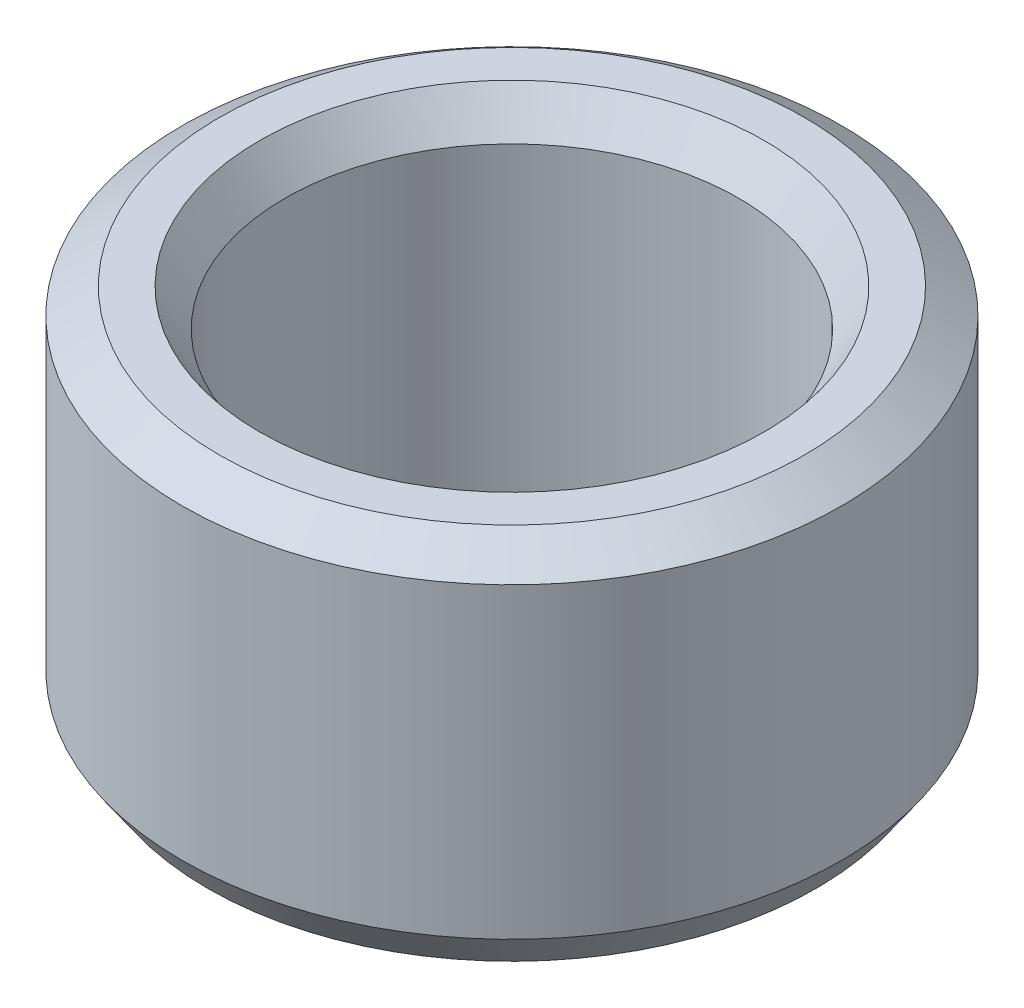
ISO-10303-21;
HEADER;
FILE_DESCRIPTION(('STEP AP214'),'2;1');
FILE_NAME('part.step','',(''),(''),'','','');
FILE_SCHEMA(('AUTOMOTIVE_DESIGN { 1 0 10303 214 1 1 1 1 }'));
ENDSEC;
DATA;
#1=APPLICATION_CONTEXT('core data for automotive mechanical design processes');
#2=APPLICATION_PROTOCOL_DEFINITION('international standard','automotive_design',2000,#1);
#3=PRODUCT_CONTEXT('',#1,'mechanical');
#4=PRODUCT('Part','Part','',(#3));
#5=PRODUCT_RELATED_PRODUCT_CATEGORY('part','',(#4));
#6=PRODUCT_DEFINITION_FORMATION('','',#4);
#7=PRODUCT_DEFINITION_CONTEXT('part definition',#1,'design');
#8=PRODUCT_DEFINITION('design','',#6,#7);
#9=PRODUCT_DEFINITION_SHAPE('','',#8);
#10=(LENGTH_UNIT() NAMED_UNIT(*) SI_UNIT(.MILLI.,.METRE.));
#11=(NAMED_UNIT(*) PLANE_ANGLE_UNIT() SI_UNIT($,.RADIAN.));
#12=(NAMED_UNIT(*) SI_UNIT($,.STERADIAN.) SOLID_ANGLE_UNIT());
#13=UNCERTAINTY_MEASURE_WITH_UNIT(LENGTH_MEASURE(1.E-05),#10,'distance_accuracy_value','');
#14=(GEOMETRIC_REPRESENTATION_CONTEXT(3) GLOBAL_UNCERTAINTY_ASSIGNED_CONTEXT((#13)) GLOBAL_UNIT_ASSIGNED_CONTEXT((#10,
#11,#12)) REPRESENTATION_CONTEXT('',''));
#15=CARTESIAN_POINT('',(0.,0.,0.));
#16=DIRECTION('',(0.,0.,1.));
#17=DIRECTION('',(1.,0.,0.));
#18=AXIS2_PLACEMENT_3D('',#15,#16,#17);
#19=CARTESIAN_POINT('',(0.,53.2833913872341,0.));
#20=DIRECTION('',(0.,-1.,0.));
#21=DIRECTION('',(0.,0.,-1.));
#22=AXIS2_PLACEMENT_3D('',#19,#20,#21);
#23=CYLINDRICAL_SURFACE('',#22,47.5);
#24=CARTESIAN_POINT('',(0.,5.34730537134247,0.));
#25=DIRECTION('',(0.,1.,0.));
#26=DIRECTION('',(0.,0.,1.));
#27=AXIS2_PLACEMENT_3D('',#24,#25,#26);
#28=CIRCLE('',#27,47.5);
#29=CARTESIAN_POINT('',(0.,5.34730537134247,47.5));
#30=VERTEX_POINT('',#29);
#31=EDGE_CURVE('E10',#30,#30,#28,.T.);
#32=ORIENTED_EDGE('',*,*,#31,.T.);
#33=EDGE_LOOP('',(#32));
#34=FACE_BOUND('',#33,.T.);
#35=CARTESIAN_POINT('',(0.,49.5969694625534,0.));
#36=DIRECTION('',(0.,1.,0.));
#37=DIRECTION('',(0.,0.,1.));
#38=AXIS2_PLACEMENT_3D('',#35,#36,#37);
#39=CIRCLE('',#38,47.5);
#40=CARTESIAN_POINT('',(0.,49.5969694625534,47.5));
#41=VERTEX_POINT('',#40);
#42=EDGE_CURVE('E50',#41,#41,#39,.F.);
#43=ORIENTED_EDGE('',*,*,#42,.T.);
#44=EDGE_LOOP('',(#43));
#45=FACE_BOUND('',#44,.T.);
#46=ADVANCED_FACE('F39',(#34,#45),#23,.T.);
#47=CARTESIAN_POINT('',(0.,53.2833913872341,0.));
#48=DIRECTION('',(0.,1.,0.));
#49=DIRECTION('',(0.,0.,1.));
#50=AXIS2_PLACEMENT_3D('',#47,#48,#49);
#51=PLANE('',#50);
#52=CARTESIAN_POINT('',(0.,53.2833913872341,0.));
#53=DIRECTION('',(0.,1.,0.));
#54=DIRECTION('',(0.,0.,1.));
#55=AXIS2_PLACEMENT_3D('',#52,#53,#54);
#56=CIRCLE('',#55,36.3748575765816);
#57=CARTESIAN_POINT('',(0.,53.2833913872341,36.3748575765816));
#58=VERTEX_POINT('',#57);
#59=EDGE_CURVE('E58',#58,#58,#56,.F.);
#60=ORIENTED_EDGE('',*,*,#59,.T.);
#61=EDGE_LOOP('',(#60));
#62=FACE_BOUND('',#61,.T.);
#63=CARTESIAN_POINT('',(0.,53.2833913872341,0.));
#64=DIRECTION('',(0.,1.,0.));
#65=DIRECTION('',(0.,0.,1.));
#66=AXIS2_PLACEMENT_3D('',#63,#64,#65);
#67=CIRCLE('',#66,42.1526946286576);
#68=CARTESIAN_POINT('',(0.,53.2833913872341,42.1526946286576));
#69=VERTEX_POINT('',#68);
#70=EDGE_CURVE('E61',#69,#69,#67,.T.);
#71=ORIENTED_EDGE('',*,*,#70,.T.);
#72=EDGE_LOOP('',(#71));
#73=FACE_BOUND('',#72,.T.);
#74=ADVANCED_FACE('F88',(#62,#73),#51,.T.);
#75=CARTESIAN_POINT('',(0.,0.,0.));
#76=DIRECTION('',(0.,1.,0.));
#77=DIRECTION('',(0.,0.,1.));
#78=AXIS2_PLACEMENT_3D('',#75,#76,#77);
#79=PLANE('',#78);
#80=CARTESIAN_POINT('',(0.,0.,0.));
#81=DIRECTION('',(0.,1.,0.));
#82=DIRECTION('',(0.,0.,1.));
#83=AXIS2_PLACEMENT_3D('',#80,#81,#82);
#84=CIRCLE('',#83,38.0357410232433);
#85=CARTESIAN_POINT('',(0.,0.,38.0357410232433));
#86=VERTEX_POINT('',#85);
#87=EDGE_CURVE('E51',#86,#86,#84,.T.);
#88=ORIENTED_EDGE('',*,*,#87,.T.);
#89=EDGE_LOOP('',(#88));
#90=FACE_BOUND('',#89,.T.);
#91=CARTESIAN_POINT('',(0.,0.,0.));
#92=DIRECTION('',(0.,1.,0.));
#93=DIRECTION('',(0.,0.,1.));
#94=AXIS2_PLACEMENT_3D('',#91,#92,#93);
#95=CIRCLE('',#94,43.8135780753193);
#96=CARTESIAN_POINT('',(0.,0.,43.8135780753193));
#97=VERTEX_POINT('',#96);
#98=EDGE_CURVE('E54',#97,#97,#95,.F.);
#99=ORIENTED_EDGE('',*,*,#98,.T.);
#100=EDGE_LOOP('',(#99));
#101=FACE_BOUND('',#100,.T.);
#102=ADVANCED_FACE('F83',(#90,#101),#79,.F.);
#103=CARTESIAN_POINT('',(0.,53.2833913872341,0.));
#104=DIRECTION('',(0.,-1.,0.));
#105=DIRECTION('',(0.,0.,-1.));
#106=AXIS2_PLACEMENT_3D('',#103,#104,#105);
#107=CYLINDRICAL_SURFACE('',#106,32.6884356519009);
#108=CARTESIAN_POINT('',(0.,47.9360860158916,0.));
#109=DIRECTION('',(0.,1.,0.));
#110=DIRECTION('',(0.,0.,1.));
#111=AXIS2_PLACEMENT_3D('',#108,#109,#110);
#112=CIRCLE('',#111,32.6884356519009);
#113=CARTESIAN_POINT('',(0.,47.9360860158916,32.6884356519009));
#114=VERTEX_POINT('',#113);
#115=EDGE_CURVE('E67',#114,#114,#112,.T.);
#116=ORIENTED_EDGE('',*,*,#115,.T.);
#117=EDGE_LOOP('',(#116));
#118=FACE_BOUND('',#117,.T.);
#119=CARTESIAN_POINT('',(0.,3.6864219246807,0.));
#120=DIRECTION('',(0.,1.,0.));
#121=DIRECTION('',(0.,0.,1.));
#122=AXIS2_PLACEMENT_3D('',#119,#120,#121);
#123=CIRCLE('',#122,32.6884356519009);
#124=CARTESIAN_POINT('',(0.,3.6864219246807,32.6884356519009));
#125=VERTEX_POINT('',#124);
#126=EDGE_CURVE('E69',#125,#125,#123,.F.);
#127=ORIENTED_EDGE('',*,*,#126,.T.);
#128=EDGE_LOOP('',(#127));
#129=FACE_BOUND('',#128,.T.);
#130=ADVANCED_FACE('F71',(#118,#129),#107,.F.);
#131=CARTESIAN_POINT('',(0.,47.9360860158916,0.));
#132=DIRECTION('',(0.,1.,0.));
#133=DIRECTION('',(0.,0.,1.));
#134=AXIS2_PLACEMENT_3D('',#131,#132,#133);
#135=CONICAL_SURFACE('',#134,32.6884356519009,0.603575069588755);
#136=ORIENTED_EDGE('',*,*,#59,.F.);
#137=EDGE_LOOP('',(#136));
#138=FACE_BOUND('',#137,.T.);
#139=ORIENTED_EDGE('',*,*,#115,.F.);
#140=EDGE_LOOP('',(#139));
#141=FACE_BOUND('',#140,.T.);
#142=ADVANCED_FACE('F77',(#138,#141),#135,.F.);
#143=CARTESIAN_POINT('',(0.,0.,0.));
#144=DIRECTION('',(0.,-1.,0.));
#145=DIRECTION('',(0.,0.,-1.));
#146=AXIS2_PLACEMENT_3D('',#143,#144,#145);
#147=CONICAL_SURFACE('',#146,38.0357410232433,0.96722125720614);
#148=ORIENTED_EDGE('',*,*,#126,.F.);
#149=EDGE_LOOP('',(#148));
#150=FACE_BOUND('',#149,.T.);
#151=ORIENTED_EDGE('',*,*,#87,.F.);
#152=EDGE_LOOP('',(#151));
#153=FACE_BOUND('',#152,.T.);
#154=ADVANCED_FACE('F73',(#150,#153),#147,.F.);
#155=CARTESIAN_POINT('',(0.,5.34730537134247,0.));
#156=DIRECTION('',(0.,1.,0.));
#157=DIRECTION('',(0.,0.,1.));
#158=AXIS2_PLACEMENT_3D('',#155,#156,#157);
#159=CONICAL_SURFACE('',#158,47.5,0.603575069588756);
#160=ORIENTED_EDGE('',*,*,#98,.F.);
#161=EDGE_LOOP('',(#160));
#162=FACE_BOUND('',#161,.T.);
#163=ORIENTED_EDGE('',*,*,#31,.F.);
#164=EDGE_LOOP('',(#163));
#165=FACE_BOUND('',#164,.T.);
#166=ADVANCED_FACE('F76',(#162,#165),#159,.T.);
#167=CARTESIAN_POINT('',(0.,53.2833913872341,0.));
#168=DIRECTION('',(0.,-1.,0.));
#169=DIRECTION('',(0.,0.,-1.));
#170=AXIS2_PLACEMENT_3D('',#167,#168,#169);
#171=CONICAL_SURFACE('',#170,42.1526946286576,0.96722125720614);
#172=ORIENTED_EDGE('',*,*,#42,.F.);
#173=EDGE_LOOP('',(#172));
#174=FACE_BOUND('',#173,.T.);
#175=ORIENTED_EDGE('',*,*,#70,.F.);
#176=EDGE_LOOP('',(#175));
#177=FACE_BOUND('',#176,.T.);
#178=ADVANCED_FACE('F45',(#174,#177),#171,.T.);
#179=CLOSED_SHELL('',(#46,#74,#102,#130,#142,#154,#166,#178));
#180=MANIFOLD_SOLID_BREP('B2',#179);
#181=ADVANCED_BREP_SHAPE_REPRESENTATION('',(#18,#180),#14);
#182=SHAPE_DEFINITION_REPRESENTATION(#9,#181);
ENDSEC;
END-ISO-10303-21;
